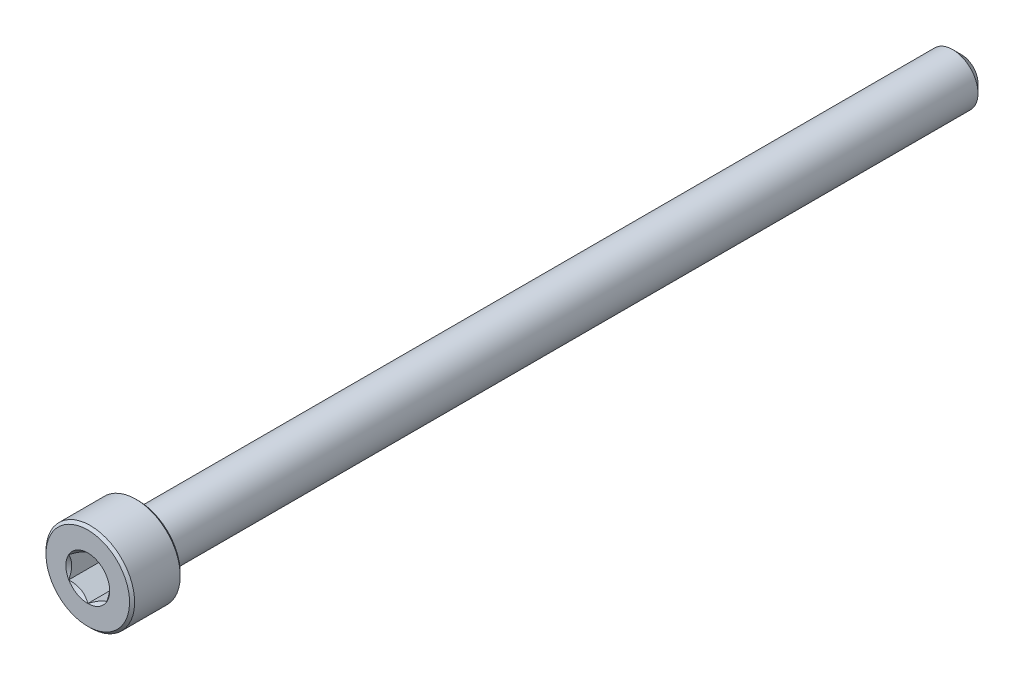
ISO-10303-21;
HEADER;
FILE_DESCRIPTION(('STEP AP214'),'2;1');
FILE_NAME('part.step','',(''),(''),'','','');
FILE_SCHEMA(('AUTOMOTIVE_DESIGN { 1 0 10303 214 1 1 1 1 }'));
ENDSEC;
DATA;
#1=APPLICATION_CONTEXT('core data for automotive mechanical design processes');
#2=APPLICATION_PROTOCOL_DEFINITION('international standard','automotive_design',2000,#1);
#3=PRODUCT_CONTEXT('',#1,'mechanical');
#4=PRODUCT('Part','Part','',(#3));
#5=PRODUCT_RELATED_PRODUCT_CATEGORY('part','',(#4));
#6=PRODUCT_DEFINITION_FORMATION('','',#4);
#7=PRODUCT_DEFINITION_CONTEXT('part definition',#1,'design');
#8=PRODUCT_DEFINITION('design','',#6,#7);
#9=PRODUCT_DEFINITION_SHAPE('','',#8);
#10=(LENGTH_UNIT() NAMED_UNIT(*) SI_UNIT(.MILLI.,.METRE.));
#11=(NAMED_UNIT(*) PLANE_ANGLE_UNIT() SI_UNIT($,.RADIAN.));
#12=(NAMED_UNIT(*) SI_UNIT($,.STERADIAN.) SOLID_ANGLE_UNIT());
#13=UNCERTAINTY_MEASURE_WITH_UNIT(LENGTH_MEASURE(1.E-05),#10,'distance_accuracy_value','');
#14=(GEOMETRIC_REPRESENTATION_CONTEXT(3) GLOBAL_UNCERTAINTY_ASSIGNED_CONTEXT((#13)) GLOBAL_UNIT_ASSIGNED_CONTEXT((#10,
#11,#12)) REPRESENTATION_CONTEXT('',''));
#15=CARTESIAN_POINT('',(0.,0.,0.));
#16=DIRECTION('',(0.,0.,1.));
#17=DIRECTION('',(1.,0.,0.));
#18=AXIS2_PLACEMENT_3D('',#15,#16,#17);
#19=CARTESIAN_POINT('',(0.,0.,34.5));
#20=DIRECTION('',(0.,0.,1.));
#21=DIRECTION('',(0.,-1.,0.));
#22=AXIS2_PLACEMENT_3D('',#19,#20,#21);
#23=PLANE('',#22);
#24=CARTESIAN_POINT('',(0.,0.,34.5));
#25=DIRECTION('',(0.,0.,1.));
#26=DIRECTION('',(1.,0.,0.));
#27=AXIS2_PLACEMENT_3D('',#24,#25,#26);
#28=CIRCLE('',#27,1.73205080756888);
#29=CARTESIAN_POINT('',(0.,-1.73205080756888,34.5));
#30=VERTEX_POINT('',#29);
#31=CARTESIAN_POINT('',(1.5,-0.866025403784438,34.5));
#32=VERTEX_POINT('',#31);
#33=EDGE_CURVE('E106',#30,#32,#28,.T.);
#34=ORIENTED_EDGE('',*,*,#33,.F.);
#35=CARTESIAN_POINT('',(-1.5,-0.866025403784438,34.5));
#36=VERTEX_POINT('',#35);
#37=EDGE_CURVE('E300',#36,#30,#28,.T.);
#38=ORIENTED_EDGE('',*,*,#37,.F.);
#39=CARTESIAN_POINT('',(-1.5,0.866025403784439,34.5));
#40=VERTEX_POINT('',#39);
#41=EDGE_CURVE('E147',#40,#36,#28,.T.);
#42=ORIENTED_EDGE('',*,*,#41,.F.);
#43=CARTESIAN_POINT('',(0.,1.73205080756888,34.5));
#44=VERTEX_POINT('',#43);
#45=EDGE_CURVE('E140',#44,#40,#28,.T.);
#46=ORIENTED_EDGE('',*,*,#45,.F.);
#47=CARTESIAN_POINT('',(1.5,0.866025403784439,34.5));
#48=VERTEX_POINT('',#47);
#49=EDGE_CURVE('E108',#48,#44,#28,.T.);
#50=ORIENTED_EDGE('',*,*,#49,.F.);
#51=EDGE_CURVE('E99',#32,#48,#28,.T.);
#52=ORIENTED_EDGE('',*,*,#51,.F.);
#53=EDGE_LOOP('',(#34,#38,#42,#46,#50,#52));
#54=FACE_BOUND('',#53,.T.);
#55=CARTESIAN_POINT('',(0.,0.,34.5));
#56=DIRECTION('',(0.,0.,-1.));
#57=DIRECTION('',(0.,1.,0.));
#58=AXIS2_PLACEMENT_3D('',#55,#56,#57);
#59=CIRCLE('',#58,3.3);
#60=CARTESIAN_POINT('',(0.,3.3,34.5));
#61=VERTEX_POINT('',#60);
#62=EDGE_CURVE('E55',#61,#61,#59,.T.);
#63=ORIENTED_EDGE('',*,*,#62,.F.);
#64=EDGE_LOOP('',(#63));
#65=FACE_BOUND('',#64,.T.);
#66=ADVANCED_FACE('F41',(#54,#65),#23,.T.);
#67=CARTESIAN_POINT('',(0.,0.,34.3));
#68=DIRECTION('',(0.,0.,-1.));
#69=DIRECTION('',(0.,1.,0.));
#70=AXIS2_PLACEMENT_3D('',#67,#68,#69);
#71=CONICAL_SURFACE('',#70,3.5,0.785398163397435);
#72=ORIENTED_EDGE('',*,*,#62,.T.);
#73=EDGE_LOOP('',(#72));
#74=FACE_BOUND('',#73,.T.);
#75=CARTESIAN_POINT('',(0.,0.,34.3));
#76=DIRECTION('',(0.,0.,-1.));
#77=DIRECTION('',(0.,1.,0.));
#78=AXIS2_PLACEMENT_3D('',#75,#76,#77);
#79=CIRCLE('',#78,3.5);
#80=CARTESIAN_POINT('',(0.,3.5,34.3));
#81=VERTEX_POINT('',#80);
#82=EDGE_CURVE('E233',#81,#81,#79,.T.);
#83=ORIENTED_EDGE('',*,*,#82,.F.);
#84=EDGE_LOOP('',(#83));
#85=FACE_BOUND('',#84,.T.);
#86=ADVANCED_FACE('F221',(#74,#85),#71,.T.);
#87=CARTESIAN_POINT('',(0.,0.,-34.5));
#88=DIRECTION('',(0.,0.,-1.));
#89=DIRECTION('',(0.,1.,0.));
#90=AXIS2_PLACEMENT_3D('',#87,#88,#89);
#91=CYLINDRICAL_SURFACE('',#90,3.5);
#92=ORIENTED_EDGE('',*,*,#82,.T.);
#93=EDGE_LOOP('',(#92));
#94=FACE_BOUND('',#93,.T.);
#95=CARTESIAN_POINT('',(0.,0.,30.7));
#96=DIRECTION('',(0.,0.,-1.));
#97=DIRECTION('',(0.,1.,0.));
#98=AXIS2_PLACEMENT_3D('',#95,#96,#97);
#99=CIRCLE('',#98,3.5);
#100=CARTESIAN_POINT('',(0.,3.5,30.7));
#101=VERTEX_POINT('',#100);
#102=EDGE_CURVE('E235',#101,#101,#99,.T.);
#103=ORIENTED_EDGE('',*,*,#102,.F.);
#104=EDGE_LOOP('',(#103));
#105=FACE_BOUND('',#104,.T.);
#106=ADVANCED_FACE('F218',(#94,#105),#91,.T.);
#107=CARTESIAN_POINT('',(0.,0.,30.5));
#108=DIRECTION('',(0.,0.,1.));
#109=DIRECTION('',(0.,-1.,0.));
#110=AXIS2_PLACEMENT_3D('',#107,#108,#109);
#111=CONICAL_SURFACE('',#110,3.3,0.785398163397434);
#112=ORIENTED_EDGE('',*,*,#102,.T.);
#113=EDGE_LOOP('',(#112));
#114=FACE_BOUND('',#113,.T.);
#115=CARTESIAN_POINT('',(0.,0.,30.5));
#116=DIRECTION('',(0.,0.,-1.));
#117=DIRECTION('',(0.,1.,0.));
#118=AXIS2_PLACEMENT_3D('',#115,#116,#117);
#119=CIRCLE('',#118,3.3);
#120=CARTESIAN_POINT('',(0.,3.3,30.5));
#121=VERTEX_POINT('',#120);
#122=EDGE_CURVE('E240',#121,#121,#119,.T.);
#123=ORIENTED_EDGE('',*,*,#122,.F.);
#124=EDGE_LOOP('',(#123));
#125=FACE_BOUND('',#124,.T.);
#126=ADVANCED_FACE('F214',(#114,#125),#111,.T.);
#127=CARTESIAN_POINT('',(0.,3.3,30.5));
#128=DIRECTION('',(0.,0.,-1.));
#129=DIRECTION('',(0.,1.,0.));
#130=AXIS2_PLACEMENT_3D('',#127,#128,#129);
#131=PLANE('',#130);
#132=ORIENTED_EDGE('',*,*,#122,.T.);
#133=EDGE_LOOP('',(#132));
#134=FACE_BOUND('',#133,.T.);
#135=CARTESIAN_POINT('',(0.,0.,30.5));
#136=DIRECTION('',(0.,0.,-1.));
#137=DIRECTION('',(0.,1.,0.));
#138=AXIS2_PLACEMENT_3D('',#135,#136,#137);
#139=CIRCLE('',#138,1.99999999999999);
#140=CARTESIAN_POINT('',(0.,1.99999999999999,30.5));
#141=VERTEX_POINT('',#140);
#142=EDGE_CURVE('E246',#141,#141,#139,.T.);
#143=ORIENTED_EDGE('',*,*,#142,.F.);
#144=EDGE_LOOP('',(#143));
#145=FACE_BOUND('',#144,.T.);
#146=ADVANCED_FACE('F210',(#134,#145),#131,.T.);
#147=CARTESIAN_POINT('',(0.,0.,-34.5));
#148=DIRECTION('',(0.,0.,-1.));
#149=DIRECTION('',(0.,1.,0.));
#150=AXIS2_PLACEMENT_3D('',#147,#148,#149);
#151=CYLINDRICAL_SURFACE('',#150,1.99999999999999);
#152=ORIENTED_EDGE('',*,*,#142,.T.);
#153=EDGE_LOOP('',(#152));
#154=FACE_BOUND('',#153,.T.);
#155=CARTESIAN_POINT('',(0.,0.,-33.8));
#156=DIRECTION('',(0.,0.,-1.));
#157=DIRECTION('',(0.,1.,0.));
#158=AXIS2_PLACEMENT_3D('',#155,#156,#157);
#159=CIRCLE('',#158,2.);
#160=CARTESIAN_POINT('',(0.,2.,-33.8));
#161=VERTEX_POINT('',#160);
#162=EDGE_CURVE('E250',#161,#161,#159,.T.);
#163=ORIENTED_EDGE('',*,*,#162,.F.);
#164=EDGE_LOOP('',(#163));
#165=FACE_BOUND('',#164,.T.);
#166=ADVANCED_FACE('F206',(#154,#165),#151,.T.);
#167=CARTESIAN_POINT('',(0.,0.,-34.5));
#168=DIRECTION('',(0.,0.,1.));
#169=DIRECTION('',(0.,-1.,0.));
#170=AXIS2_PLACEMENT_3D('',#167,#168,#169);
#171=CONICAL_SURFACE('',#170,1.3,0.785398163397449);
#172=ORIENTED_EDGE('',*,*,#162,.T.);
#173=EDGE_LOOP('',(#172));
#174=FACE_BOUND('',#173,.T.);
#175=CARTESIAN_POINT('',(0.,0.,-34.5));
#176=DIRECTION('',(0.,0.,-1.));
#177=DIRECTION('',(0.,1.,0.));
#178=AXIS2_PLACEMENT_3D('',#175,#176,#177);
#179=CIRCLE('',#178,1.3);
#180=CARTESIAN_POINT('',(0.,1.3,-34.5));
#181=VERTEX_POINT('',#180);
#182=EDGE_CURVE('E254',#181,#181,#179,.T.);
#183=ORIENTED_EDGE('',*,*,#182,.F.);
#184=EDGE_LOOP('',(#183));
#185=FACE_BOUND('',#184,.T.);
#186=ADVANCED_FACE('F202',(#174,#185),#171,.T.);
#187=CARTESIAN_POINT('',(0.,1.3,-34.5));
#188=DIRECTION('',(0.,0.,-1.));
#189=DIRECTION('',(0.,1.,0.));
#190=AXIS2_PLACEMENT_3D('',#187,#188,#189);
#191=PLANE('',#190);
#192=ORIENTED_EDGE('',*,*,#182,.T.);
#193=EDGE_LOOP('',(#192));
#194=FACE_BOUND('',#193,.T.);
#195=ADVANCED_FACE('F199',(#194),#191,.T.);
#196=CARTESIAN_POINT('',(0.,0.,34.5));
#197=DIRECTION('',(0.,0.,1.));
#198=DIRECTION('',(1.,0.,0.));
#199=AXIS2_PLACEMENT_3D('',#196,#197,#198);
#200=CONICAL_SURFACE('',#199,1.73205080756888,0.78539816339745);
#201=ORIENTED_EDGE('',*,*,#33,.T.);
#202=CARTESIAN_POINT('',(-0.000199999999999772,-1.73216627762271,34.5001154816001));
#203=CARTESIAN_POINT('',(0.0513677907370751,-1.70239359975915,34.4703654760673));
#204=CARTESIAN_POINT('',(0.103797917665199,-1.67212305186355,34.4423624839103));
#205=CARTESIAN_POINT('',(0.210709034055595,-1.61039789003619,34.3910892304401));
#206=CARTESIAN_POINT('',(0.26520019581466,-1.57893740312614,34.3678475050444));
#207=CARTESIAN_POINT('',(0.375079081357247,-1.51549879897987,34.3280337289922));
#208=CARTESIAN_POINT('',(0.430438809095198,-1.4835368452681,34.3113615856709));
#209=CARTESIAN_POINT('',(0.542377257477148,-1.41890915196211,34.2856744568181));
#210=CARTESIAN_POINT('',(0.598952556553006,-1.38624538781118,34.2766402904789));
#211=CARTESIAN_POINT('',(0.696455389516438,-1.329952100953,34.2684890812269));
#212=CARTESIAN_POINT('',(0.737256908280463,-1.30639533311124,34.2672822529892));
#213=CARTESIAN_POINT('',(0.818787969615855,-1.25932335290193,34.2693140571623));
#214=CARTESIAN_POINT('',(0.859517494314627,-1.23580815085313,34.2725536707483));
#215=CARTESIAN_POINT('',(0.940584402163413,-1.18900414978427,34.283291985982));
#216=CARTESIAN_POINT('',(0.980921384598285,-1.1657155821172,34.2907946530187));
#217=CARTESIAN_POINT('',(1.06091833691403,-1.11952932016335,34.3096516119283));
#218=CARTESIAN_POINT('',(1.1005780085162,-1.09663179808786,34.3210075570186));
#219=CARTESIAN_POINT('',(1.20216313477448,-1.03798159809699,34.3547216475927));
#220=CARTESIAN_POINT('',(1.26345855370968,-1.00259267147465,34.3796218490934));
#221=CARTESIAN_POINT('',(1.35358562846331,-0.950557780604376,34.4216566532716));
#222=CARTESIAN_POINT('',(1.38328513990771,-0.933410759677149,34.4364251535591));
#223=CARTESIAN_POINT('',(1.44213790138375,-0.899432101996408,34.4673105659402));
#224=CARTESIAN_POINT('',(1.47129140422064,-0.88260031928571,34.4834268341217));
#225=CARTESIAN_POINT('',(1.5002,-0.865909933730599,34.5001154816001));
#226=B_SPLINE_CURVE_WITH_KNOTS('',3,(#202,#203,#204,#205,#206,#207,#208,#209,#210,#211,#212,
#213,#214,#215,#216,#217,#218,#219,#220,#221,#222,#223,#224,#225),.UNSPECIFIED.,.F.,.F.,(4,2,2,
2,2,2,2,2,2,2,2,4),(0.,0.199829143693301,0.400822987382388,0.598623720538179,0.795926240188886,
0.937113067959878,1.07833105577192,1.21968061668222,1.36109089931054,1.58570969637565,
1.69770705470963,1.80965120737194),.UNSPECIFIED.);
#227=EDGE_CURVE('E12',#30,#32,#226,.T.);
#228=ORIENTED_EDGE('',*,*,#227,.F.);
#229=EDGE_LOOP('',(#201,#228));
#230=FACE_BOUND('',#229,.T.);
#231=ADVANCED_FACE('F165',(#230),#200,.F.);
#232=ORIENTED_EDGE('',*,*,#37,.T.);
#233=CARTESIAN_POINT('',(-1.5002,-0.8659099337306,34.5001154816001));
#234=CARTESIAN_POINT('',(-1.44863220926292,-0.895682611594165,34.4703654760673));
#235=CARTESIAN_POINT('',(-1.3962020823348,-0.925953159489764,34.4423624839103));
#236=CARTESIAN_POINT('',(-1.2892909659444,-0.987678321317123,34.3910892304401));
#237=CARTESIAN_POINT('',(-1.23479980418534,-1.01913880822717,34.3678475050444));
#238=CARTESIAN_POINT('',(-1.12492091864275,-1.08257741237344,34.3280337289922));
#239=CARTESIAN_POINT('',(-1.0695611909048,-1.11453936608521,34.3113615856709));
#240=CARTESIAN_POINT('',(-0.957622742522849,-1.1791670593912,34.2856744568181));
#241=CARTESIAN_POINT('',(-0.901047443446992,-1.21183082354213,34.2766402904789));
#242=CARTESIAN_POINT('',(-0.803544610483562,-1.26812411040032,34.2684890812269));
#243=CARTESIAN_POINT('',(-0.762743091719536,-1.29168087824207,34.2672822529892));
#244=CARTESIAN_POINT('',(-0.681212030384145,-1.33875285845138,34.2693140571623));
#245=CARTESIAN_POINT('',(-0.640482505685373,-1.36226806050018,34.2725536707483));
#246=CARTESIAN_POINT('',(-0.559415597836587,-1.40907206156905,34.283291985982));
#247=CARTESIAN_POINT('',(-0.519078615401714,-1.43236062923612,34.2907946530187));
#248=CARTESIAN_POINT('',(-0.439081663085971,-1.47854689118996,34.3096516119283));
#249=CARTESIAN_POINT('',(-0.399421991483795,-1.50144441326545,34.3210075570186));
#250=CARTESIAN_POINT('',(-0.297836865225519,-1.56009461325633,34.3547216475927));
#251=CARTESIAN_POINT('',(-0.236541446290314,-1.59548353987866,34.3796218490934));
#252=CARTESIAN_POINT('',(-0.146414371536689,-1.64751843074894,34.4216566532716));
#253=CARTESIAN_POINT('',(-0.116714860092283,-1.66466545167617,34.4364251535591));
#254=CARTESIAN_POINT('',(-0.0578620986162486,-1.69864410935691,34.4673105659402));
#255=CARTESIAN_POINT('',(-0.0287085957793621,-1.7154758920676,34.4834268341217));
#256=CARTESIAN_POINT('',(0.000200000000000444,-1.73216627762271,34.5001154816001));
#257=B_SPLINE_CURVE_WITH_KNOTS('',3,(#233,#234,#235,#236,#237,#238,#239,#240,#241,#242,#243,
#244,#245,#246,#247,#248,#249,#250,#251,#252,#253,#254,#255,#256),.UNSPECIFIED.,.F.,.F.,(4,2,2,
2,2,2,2,2,2,2,2,4),(0.,0.199829143693308,0.400822987382388,0.598623720538182,0.795926240188887,
0.937113067959878,1.07833105577192,1.21968061668221,1.36109089931054,1.58570969637565,
1.69770705470963,1.80965120737194),.UNSPECIFIED.);
#258=EDGE_CURVE('E142',#36,#30,#257,.T.);
#259=ORIENTED_EDGE('',*,*,#258,.F.);
#260=EDGE_LOOP('',(#232,#259));
#261=FACE_BOUND('',#260,.T.);
#262=ADVANCED_FACE('F298',(#261),#200,.F.);
#263=ORIENTED_EDGE('',*,*,#41,.T.);
#264=CARTESIAN_POINT('',(-1.5,-1.72720812969692,35.0555785162708));
#265=CARTESIAN_POINT('',(-1.5,-1.68515175699268,35.0238299078574));
#266=CARTESIAN_POINT('',(-1.5,-1.64286104748673,34.9923925938074));
#267=CARTESIAN_POINT('',(-1.5,-1.55771581035942,34.9302690875564));
#268=CARTESIAN_POINT('',(-1.5,-1.51486114386668,34.8995830858922));
#269=CARTESIAN_POINT('',(-1.5,-1.3846813415127,34.8084071924272));
#270=CARTESIAN_POINT('',(-1.5,-1.29637976071654,34.7492883434268));
#271=CARTESIAN_POINT('',(-1.5,-1.11121478730467,34.6332309963165));
#272=CARTESIAN_POINT('',(-1.5,-1.01415038238167,34.576609558733));
#273=CARTESIAN_POINT('',(-1.5,-0.815173408897607,34.4730368812657));
#274=CARTESIAN_POINT('',(-1.5,-0.713278669253288,34.4260530415417));
#275=CARTESIAN_POINT('',(-1.5,-0.560333774943114,34.3685726684308));
#276=CARTESIAN_POINT('',(-1.5,-0.511547982948044,34.3520753877573));
#277=CARTESIAN_POINT('',(-1.5,-0.412798620136868,34.322997512927));
#278=CARTESIAN_POINT('',(-1.5,-0.362834968437563,34.310417188594));
#279=CARTESIAN_POINT('',(-1.5,-0.262863235444982,34.2900361941468));
#280=CARTESIAN_POINT('',(-1.5,-0.212872113808023,34.282153632746));
#281=CARTESIAN_POINT('',(-1.5,-0.112355243569545,34.271322063969));
#282=CARTESIAN_POINT('',(-1.5,-0.0618295883726281,34.2683722085243));
#283=CARTESIAN_POINT('',(-1.5,0.0374291733323835,34.2676248577249));
#284=CARTESIAN_POINT('',(-1.5,0.086160967200298,34.2696447335581));
#285=CARTESIAN_POINT('',(-1.5,0.183206937768826,34.2783225528968));
#286=CARTESIAN_POINT('',(-1.5,0.231521073438268,34.2849809469685));
#287=CARTESIAN_POINT('',(-1.5,0.328199853425435,34.3026852441226));
#288=CARTESIAN_POINT('',(-1.5,0.376550616310327,34.313805811257));
#289=CARTESIAN_POINT('',(-1.5,0.472195697125597,34.3398434140487));
#290=CARTESIAN_POINT('',(-1.5,0.519490103092739,34.3547601320409));
#291=CARTESIAN_POINT('',(-1.5,0.668391282696625,34.4073352235961));
#292=CARTESIAN_POINT('',(-1.5,0.767878709508554,34.450981287472));
#293=CARTESIAN_POINT('',(-1.5,0.962179866690723,34.5480229945931));
#294=CARTESIAN_POINT('',(-1.5,1.05697519961444,34.6014536650895));
#295=CARTESIAN_POINT('',(-1.5,1.23814273533382,34.7116858520046));
#296=CARTESIAN_POINT('',(-1.5,1.32469942181289,34.7681879206986));
#297=CARTESIAN_POINT('',(-1.5,1.45222331290673,34.8555343015787));
#298=CARTESIAN_POINT('',(-1.5,1.49418091978755,34.88495775868));
#299=CARTESIAN_POINT('',(-1.5,1.57752272931476,34.9445828218305));
#300=CARTESIAN_POINT('',(-1.5,1.61890708647353,34.9747842116644));
#301=CARTESIAN_POINT('',(-1.5,1.66005278019493,35.0053081786095));
#302=B_SPLINE_CURVE_WITH_KNOTS('',3,(#264,#265,#266,#267,#268,#269,#270,#271,#272,#273,#274,
#275,#276,#277,#278,#279,#280,#281,#282,#283,#284,#285,#286,#287,#288,#289,#290,#291,#292,#293,
#294,#295,#296,#297,#298,#299,#300,#301),.UNSPECIFIED.,.F.,.F.,(4,2,2,2,2,2,2,2,2,2,2,2,2,2,2,2,
2,2,4),(0.,0.158079548982671,0.316198780993938,0.634850417346953,0.971690311361504,
1.30737131660667,1.46173961127088,1.61611853740677,1.76772101421409,1.91929742368538,
2.065387412096,2.21149159305544,2.36014984633872,2.50879566386709,2.83376031422673,
3.15991186985651,3.46985601802197,3.62358896039973,3.77727962642069),.UNSPECIFIED.);
#303=EDGE_CURVE('E145',#40,#36,#302,.F.);
#304=ORIENTED_EDGE('',*,*,#303,.F.);
#305=EDGE_LOOP('',(#263,#304));
#306=FACE_BOUND('',#305,.T.);
#307=ADVANCED_FACE('F303',(#306),#200,.F.);
#308=ORIENTED_EDGE('',*,*,#45,.T.);
#309=CARTESIAN_POINT('',(0.000200000000000089,1.73216627762271,34.5001154816001));
#310=CARTESIAN_POINT('',(-0.0513677907370767,1.70239359975915,34.4703654760673));
#311=CARTESIAN_POINT('',(-0.103797917665202,1.67212305186355,34.4423624839103));
#312=CARTESIAN_POINT('',(-0.210709034055597,1.61039789003619,34.3910892304401));
#313=CARTESIAN_POINT('',(-0.26520019581466,1.57893740312614,34.3678475050444));
#314=CARTESIAN_POINT('',(-0.375079081357247,1.51549879897987,34.3280337289922));
#315=CARTESIAN_POINT('',(-0.430438809095198,1.4835368452681,34.3113615856709));
#316=CARTESIAN_POINT('',(-0.542377257477148,1.41890915196211,34.2856744568181));
#317=CARTESIAN_POINT('',(-0.598952556553006,1.38624538781118,34.2766402904789));
#318=CARTESIAN_POINT('',(-0.696455389516438,1.329952100953,34.2684890812269));
#319=CARTESIAN_POINT('',(-0.737256908280463,1.30639533311124,34.2672822529892));
#320=CARTESIAN_POINT('',(-0.818787969615854,1.25932335290194,34.2693140571623));
#321=CARTESIAN_POINT('',(-0.859517494314626,1.23580815085313,34.2725536707483));
#322=CARTESIAN_POINT('',(-0.940584402163412,1.18900414978427,34.283291985982));
#323=CARTESIAN_POINT('',(-0.980921384598284,1.1657155821172,34.2907946530187));
#324=CARTESIAN_POINT('',(-1.06091833691403,1.11952932016335,34.3096516119283));
#325=CARTESIAN_POINT('',(-1.1005780085162,1.09663179808786,34.3210075570186));
#326=CARTESIAN_POINT('',(-1.20216313477448,1.03798159809698,34.3547216475927));
#327=CARTESIAN_POINT('',(-1.26345855370969,1.00259267147465,34.3796218490934));
#328=CARTESIAN_POINT('',(-1.35358562846331,0.950557780604373,34.4216566532716));
#329=CARTESIAN_POINT('',(-1.38328513990772,0.933410759677146,34.4364251535591));
#330=CARTESIAN_POINT('',(-1.44213790138375,0.899432101996405,34.4673105659402));
#331=CARTESIAN_POINT('',(-1.47129140422064,0.882600319285709,34.4834268341217));
#332=CARTESIAN_POINT('',(-1.5002,0.8659099337306,34.5001154816001));
#333=B_SPLINE_CURVE_WITH_KNOTS('',3,(#309,#310,#311,#312,#313,#314,#315,#316,#317,#318,#319,
#320,#321,#322,#323,#324,#325,#326,#327,#328,#329,#330,#331,#332),.UNSPECIFIED.,.F.,.F.,(4,2,2,
2,2,2,2,2,2,2,2,4),(0.,0.199829143693305,0.400822987382387,0.598623720538179,0.795926240188887,
0.937113067959878,1.07833105577192,1.21968061668222,1.36109089931054,1.58570969637565,
1.69770705470964,1.80965120737194),.UNSPECIFIED.);
#334=EDGE_CURVE('E119',#44,#40,#333,.T.);
#335=ORIENTED_EDGE('',*,*,#334,.F.);
#336=EDGE_LOOP('',(#308,#335));
#337=FACE_BOUND('',#336,.T.);
#338=ADVANCED_FACE('F342',(#337),#200,.F.);
#339=ORIENTED_EDGE('',*,*,#49,.T.);
#340=CARTESIAN_POINT('',(1.5002,0.8659099337306,34.5001154816001));
#341=CARTESIAN_POINT('',(1.44863220926292,0.895682611594165,34.4703654760673));
#342=CARTESIAN_POINT('',(1.3962020823348,0.925953159489764,34.4423624839103));
#343=CARTESIAN_POINT('',(1.2892909659444,0.987678321317122,34.3910892304401));
#344=CARTESIAN_POINT('',(1.23479980418534,1.01913880822717,34.3678475050444));
#345=CARTESIAN_POINT('',(1.12492091864275,1.08257741237344,34.3280337289922));
#346=CARTESIAN_POINT('',(1.0695611909048,1.11453936608521,34.3113615856709));
#347=CARTESIAN_POINT('',(0.957622742522852,1.1791670593912,34.2856744568181));
#348=CARTESIAN_POINT('',(0.901047443446994,1.21183082354213,34.2766402904789));
#349=CARTESIAN_POINT('',(0.803544610483562,1.26812411040032,34.2684890812269));
#350=CARTESIAN_POINT('',(0.762743091719537,1.29168087824207,34.2672822529892));
#351=CARTESIAN_POINT('',(0.681212030384144,1.33875285845138,34.2693140571623));
#352=CARTESIAN_POINT('',(0.640482505685373,1.36226806050018,34.2725536707483));
#353=CARTESIAN_POINT('',(0.559415597836587,1.40907206156905,34.283291985982));
#354=CARTESIAN_POINT('',(0.519078615401715,1.43236062923612,34.2907946530187));
#355=CARTESIAN_POINT('',(0.439081663085972,1.47854689118996,34.3096516119283));
#356=CARTESIAN_POINT('',(0.399421991483796,1.50144441326545,34.3210075570186));
#357=CARTESIAN_POINT('',(0.297836865225519,1.56009461325633,34.3547216475927));
#358=CARTESIAN_POINT('',(0.236541446290314,1.59548353987866,34.3796218490934));
#359=CARTESIAN_POINT('',(0.14641437153669,1.64751843074894,34.4216566532716));
#360=CARTESIAN_POINT('',(0.116714860092286,1.66466545167616,34.4364251535591));
#361=CARTESIAN_POINT('',(0.057862098616252,1.69864410935691,34.4673105659402));
#362=CARTESIAN_POINT('',(0.0287085957793641,1.7154758920676,34.4834268341217));
#363=CARTESIAN_POINT('',(-0.000200000000000555,1.73216627762271,34.5001154816001));
#364=B_SPLINE_CURVE_WITH_KNOTS('',3,(#340,#341,#342,#343,#344,#345,#346,#347,#348,#349,#350,
#351,#352,#353,#354,#355,#356,#357,#358,#359,#360,#361,#362,#363),.UNSPECIFIED.,.F.,.F.,(4,2,2,
2,2,2,2,2,2,2,2,4),(0.,0.199829143693303,0.400822987382388,0.598623720538179,0.795926240188886,
0.937113067959878,1.07833105577192,1.21968061668222,1.36109089931054,1.58570969637565,
1.69770705470963,1.80965120737194),.UNSPECIFIED.);
#365=EDGE_CURVE('E111',#48,#44,#364,.T.);
#366=ORIENTED_EDGE('',*,*,#365,.F.);
#367=EDGE_LOOP('',(#339,#366));
#368=FACE_BOUND('',#367,.T.);
#369=ADVANCED_FACE('F112',(#368),#200,.F.);
#370=ORIENTED_EDGE('',*,*,#51,.T.);
#371=CARTESIAN_POINT('',(1.5,-1.72720812969692,35.0555785162708));
#372=CARTESIAN_POINT('',(1.5,-1.68515175699267,35.0238299078574));
#373=CARTESIAN_POINT('',(1.5,-1.64286104748673,34.9923925938074));
#374=CARTESIAN_POINT('',(1.5,-1.55771581035941,34.9302690875564));
#375=CARTESIAN_POINT('',(1.5,-1.51486114386667,34.8995830858922));
#376=CARTESIAN_POINT('',(1.5,-1.38468134151269,34.8084071924272));
#377=CARTESIAN_POINT('',(1.5,-1.29637976071653,34.7492883434268));
#378=CARTESIAN_POINT('',(1.5,-1.11121478730466,34.6332309963165));
#379=CARTESIAN_POINT('',(1.5,-1.01415038238166,34.576609558733));
#380=CARTESIAN_POINT('',(1.5,-0.815173408897596,34.4730368812656));
#381=CARTESIAN_POINT('',(1.5,-0.713278669253279,34.4260530415417));
#382=CARTESIAN_POINT('',(1.5,-0.560333774943106,34.3685726684308));
#383=CARTESIAN_POINT('',(1.5,-0.511547982948036,34.3520753877573));
#384=CARTESIAN_POINT('',(1.5,-0.41279862013686,34.322997512927));
#385=CARTESIAN_POINT('',(1.5,-0.362834968437556,34.310417188594));
#386=CARTESIAN_POINT('',(1.5,-0.262863235444976,34.2900361941468));
#387=CARTESIAN_POINT('',(1.5,-0.212872113808017,34.282153632746));
#388=CARTESIAN_POINT('',(1.5,-0.112355243569541,34.271322063969));
#389=CARTESIAN_POINT('',(1.5,-0.0618295883726233,34.2683722085244));
#390=CARTESIAN_POINT('',(1.5,0.0374291733323881,34.2676248577249));
#391=CARTESIAN_POINT('',(1.5,0.0861609672003026,34.2696447335581));
#392=CARTESIAN_POINT('',(1.5,0.18320693776883,34.2783225528968));
#393=CARTESIAN_POINT('',(1.5,0.231521073438272,34.2849809469685));
#394=CARTESIAN_POINT('',(1.5,0.328199853425439,34.3026852441226));
#395=CARTESIAN_POINT('',(1.5,0.376550616310331,34.313805811257));
#396=CARTESIAN_POINT('',(1.5,0.472195697125601,34.3398434140487));
#397=CARTESIAN_POINT('',(1.5,0.519490103092742,34.3547601320409));
#398=CARTESIAN_POINT('',(1.5,0.668391282696626,34.4073352235961));
#399=CARTESIAN_POINT('',(1.5,0.767878709508553,34.450981287472));
#400=CARTESIAN_POINT('',(1.5,0.962179866690724,34.5480229945931));
#401=CARTESIAN_POINT('',(1.5,1.05697519961444,34.6014536650895));
#402=CARTESIAN_POINT('',(1.5,1.23814273533383,34.7116858520046));
#403=CARTESIAN_POINT('',(1.5,1.3246994218129,34.7681879206986));
#404=CARTESIAN_POINT('',(1.5,1.45222331290674,34.8555343015787));
#405=CARTESIAN_POINT('',(1.5,1.49418091978756,34.8849577586801));
#406=CARTESIAN_POINT('',(1.5,1.57752272931477,34.9445828218305));
#407=CARTESIAN_POINT('',(1.5,1.61890708647355,34.9747842116644));
#408=CARTESIAN_POINT('',(1.5,1.66005278019494,35.0053081786095));
#409=B_SPLINE_CURVE_WITH_KNOTS('',3,(#371,#372,#373,#374,#375,#376,#377,#378,#379,#380,#381,
#382,#383,#384,#385,#386,#387,#388,#389,#390,#391,#392,#393,#394,#395,#396,#397,#398,#399,#400,
#401,#402,#403,#404,#405,#406,#407,#408),.UNSPECIFIED.,.F.,.F.,(4,2,2,2,2,2,2,2,2,2,2,2,2,2,2,2,
2,2,4),(0.,0.158079548982668,0.316198780993944,0.634850417346959,0.971690311361511,
1.30737131660667,1.46173961127088,1.61611853740677,1.76772101421409,1.91929742368537,
2.06538741209599,2.21149159305543,2.36014984633871,2.50879566386708,2.83376031422672,
3.15991186985651,3.46985601802197,3.62358896039973,3.7772796264207),.UNSPECIFIED.);
#410=EDGE_CURVE('E61',#32,#48,#409,.T.);
#411=ORIENTED_EDGE('',*,*,#410,.F.);
#412=EDGE_LOOP('',(#370,#411));
#413=FACE_BOUND('',#412,.T.);
#414=ADVANCED_FACE('F101',(#413),#200,.F.);
#415=CARTESIAN_POINT('',(0.,3.3,31.5));
#416=DIRECTION('',(0.,0.,-1.));
#417=DIRECTION('',(0.,1.,0.));
#418=AXIS2_PLACEMENT_3D('',#415,#416,#417);
#419=PLANE('',#418);
#420=DIRECTION('',(0.866025403784439,0.5,0.));
#421=VECTOR('',#420,1.);
#422=CARTESIAN_POINT('',(0.,-1.73205080756888,31.5));
#423=LINE('',#422,#421);
#424=CARTESIAN_POINT('',(0.,-1.73205080756888,31.5));
#425=VERTEX_POINT('',#424);
#426=CARTESIAN_POINT('',(1.5,-0.866025403784437,31.5));
#427=VERTEX_POINT('',#426);
#428=EDGE_CURVE('E259',#425,#427,#423,.T.);
#429=ORIENTED_EDGE('',*,*,#428,.T.);
#430=DIRECTION('',(0.,1.,0.));
#431=VECTOR('',#430,1.);
#432=CARTESIAN_POINT('',(1.5,-0.866025403784437,31.5));
#433=LINE('',#432,#431);
#434=CARTESIAN_POINT('',(1.5,0.866025403784438,31.5));
#435=VERTEX_POINT('',#434);
#436=EDGE_CURVE('E130',#427,#435,#433,.T.);
#437=ORIENTED_EDGE('',*,*,#436,.T.);
#438=DIRECTION('',(-0.866025403784439,0.5,0.));
#439=VECTOR('',#438,1.);
#440=CARTESIAN_POINT('',(1.5,0.866025403784438,31.5));
#441=LINE('',#440,#439);
#442=CARTESIAN_POINT('',(0.,1.73205080756888,31.5));
#443=VERTEX_POINT('',#442);
#444=EDGE_CURVE('E134',#435,#443,#441,.T.);
#445=ORIENTED_EDGE('',*,*,#444,.T.);
#446=DIRECTION('',(-0.866025403784439,-0.5,0.));
#447=VECTOR('',#446,1.);
#448=CARTESIAN_POINT('',(0.,1.73205080756888,31.5));
#449=LINE('',#448,#447);
#450=CARTESIAN_POINT('',(-1.5,0.866025403784438,31.5));
#451=VERTEX_POINT('',#450);
#452=EDGE_CURVE('E264',#443,#451,#449,.T.);
#453=ORIENTED_EDGE('',*,*,#452,.T.);
#454=DIRECTION('',(0.,-1.,0.));
#455=VECTOR('',#454,1.);
#456=CARTESIAN_POINT('',(-1.5,0.866025403784438,31.5));
#457=LINE('',#456,#455);
#458=CARTESIAN_POINT('',(-1.5,-0.866025403784438,31.5));
#459=VERTEX_POINT('',#458);
#460=EDGE_CURVE('E269',#451,#459,#457,.T.);
#461=ORIENTED_EDGE('',*,*,#460,.T.);
#462=DIRECTION('',(0.866025403784439,-0.5,0.));
#463=VECTOR('',#462,1.);
#464=CARTESIAN_POINT('',(-1.5,-0.866025403784438,31.5));
#465=LINE('',#464,#463);
#466=EDGE_CURVE('E272',#459,#425,#465,.T.);
#467=ORIENTED_EDGE('',*,*,#466,.T.);
#468=EDGE_LOOP('',(#429,#437,#445,#453,#461,#467));
#469=FACE_BOUND('',#468,.T.);
#470=ADVANCED_FACE('F164',(#469),#419,.F.);
#471=CARTESIAN_POINT('',(0.,-1.73205080756888,25.9174243050442));
#472=DIRECTION('',(0.5,-0.866025403784438,0.));
#473=DIRECTION('',(0.866025403784439,0.5,0.));
#474=AXIS2_PLACEMENT_3D('',#471,#472,#473);
#475=PLANE('',#474);
#476=DIRECTION('',(0.,0.,1.));
#477=VECTOR('',#476,1.);
#478=CARTESIAN_POINT('',(0.,-1.73205080756888,25.9174243050442));
#479=LINE('',#478,#477);
#480=EDGE_CURVE('E273',#425,#30,#479,.T.);
#481=ORIENTED_EDGE('',*,*,#480,.T.);
#482=ORIENTED_EDGE('',*,*,#227,.T.);
#483=DIRECTION('',(0.,0.,1.));
#484=VECTOR('',#483,1.);
#485=CARTESIAN_POINT('',(1.5,-0.866025403784437,25.9174243050442));
#486=LINE('',#485,#484);
#487=EDGE_CURVE('E128',#427,#32,#486,.T.);
#488=ORIENTED_EDGE('',*,*,#487,.F.);
#489=ORIENTED_EDGE('',*,*,#428,.F.);
#490=EDGE_LOOP('',(#481,#482,#488,#489));
#491=FACE_BOUND('',#490,.T.);
#492=ADVANCED_FACE('F166',(#491),#475,.F.);
#493=CARTESIAN_POINT('',(-1.5,-0.866025403784438,25.9174243050442));
#494=DIRECTION('',(-0.5,-0.866025403784439,0.));
#495=DIRECTION('',(0.866025403784439,-0.5,0.));
#496=AXIS2_PLACEMENT_3D('',#493,#494,#495);
#497=PLANE('',#496);
#498=DIRECTION('',(0.,0.,1.));
#499=VECTOR('',#498,1.);
#500=CARTESIAN_POINT('',(-1.5,-0.866025403784438,25.9174243050442));
#501=LINE('',#500,#499);
#502=EDGE_CURVE('E69',#459,#36,#501,.T.);
#503=ORIENTED_EDGE('',*,*,#502,.T.);
#504=ORIENTED_EDGE('',*,*,#258,.T.);
#505=ORIENTED_EDGE('',*,*,#480,.F.);
#506=ORIENTED_EDGE('',*,*,#466,.F.);
#507=EDGE_LOOP('',(#503,#504,#505,#506));
#508=FACE_BOUND('',#507,.T.);
#509=ADVANCED_FACE('F160',(#508),#497,.F.);
#510=CARTESIAN_POINT('',(-1.5,0.866025403784438,25.9174243050442));
#511=DIRECTION('',(-1.,0.,0.));
#512=DIRECTION('',(0.,-1.,0.));
#513=AXIS2_PLACEMENT_3D('',#510,#511,#512);
#514=PLANE('',#513);
#515=DIRECTION('',(0.,0.,1.));
#516=VECTOR('',#515,1.);
#517=CARTESIAN_POINT('',(-1.5,0.866025403784438,25.9174243050442));
#518=LINE('',#517,#516);
#519=EDGE_CURVE('E265',#451,#40,#518,.T.);
#520=ORIENTED_EDGE('',*,*,#519,.T.);
#521=ORIENTED_EDGE('',*,*,#303,.T.);
#522=ORIENTED_EDGE('',*,*,#502,.F.);
#523=ORIENTED_EDGE('',*,*,#460,.F.);
#524=EDGE_LOOP('',(#520,#521,#522,#523));
#525=FACE_BOUND('',#524,.T.);
#526=ADVANCED_FACE('F314',(#525),#514,.F.);
#527=CARTESIAN_POINT('',(0.,1.73205080756888,25.9174243050442));
#528=DIRECTION('',(-0.5,0.866025403784439,0.));
#529=DIRECTION('',(-0.866025403784439,-0.5,0.));
#530=AXIS2_PLACEMENT_3D('',#527,#528,#529);
#531=PLANE('',#530);
#532=DIRECTION('',(0.,0.,1.));
#533=VECTOR('',#532,1.);
#534=CARTESIAN_POINT('',(0.,1.73205080756888,25.9174243050442));
#535=LINE('',#534,#533);
#536=EDGE_CURVE('E261',#443,#44,#535,.T.);
#537=ORIENTED_EDGE('',*,*,#536,.T.);
#538=ORIENTED_EDGE('',*,*,#334,.T.);
#539=ORIENTED_EDGE('',*,*,#519,.F.);
#540=ORIENTED_EDGE('',*,*,#452,.F.);
#541=EDGE_LOOP('',(#537,#538,#539,#540));
#542=FACE_BOUND('',#541,.T.);
#543=ADVANCED_FACE('F191',(#542),#531,.F.);
#544=CARTESIAN_POINT('',(1.5,0.866025403784438,25.9174243050442));
#545=DIRECTION('',(0.5,0.866025403784439,0.));
#546=DIRECTION('',(-0.866025403784439,0.5,0.));
#547=AXIS2_PLACEMENT_3D('',#544,#545,#546);
#548=PLANE('',#547);
#549=DIRECTION('',(0.,0.,1.));
#550=VECTOR('',#549,1.);
#551=CARTESIAN_POINT('',(1.5,0.866025403784438,25.9174243050442));
#552=LINE('',#551,#550);
#553=EDGE_CURVE('E125',#435,#48,#552,.T.);
#554=ORIENTED_EDGE('',*,*,#553,.T.);
#555=ORIENTED_EDGE('',*,*,#365,.T.);
#556=ORIENTED_EDGE('',*,*,#536,.F.);
#557=ORIENTED_EDGE('',*,*,#444,.F.);
#558=EDGE_LOOP('',(#554,#555,#556,#557));
#559=FACE_BOUND('',#558,.T.);
#560=ADVANCED_FACE('F132',(#559),#548,.F.);
#561=CARTESIAN_POINT('',(1.5,-0.866025403784437,25.9174243050442));
#562=DIRECTION('',(1.,0.,0.));
#563=DIRECTION('',(0.,1.,0.));
#564=AXIS2_PLACEMENT_3D('',#561,#562,#563);
#565=PLANE('',#564);
#566=ORIENTED_EDGE('',*,*,#487,.T.);
#567=ORIENTED_EDGE('',*,*,#410,.T.);
#568=ORIENTED_EDGE('',*,*,#553,.F.);
#569=ORIENTED_EDGE('',*,*,#436,.F.);
#570=EDGE_LOOP('',(#566,#567,#568,#569));
#571=FACE_BOUND('',#570,.T.);
#572=ADVANCED_FACE('F124',(#571),#565,.F.);
#573=CLOSED_SHELL('',(#66,#86,#106,#126,#146,#166,#186,#195,#231,#262,#307,#338,#369,#414,#470,
#492,#509,#526,#543,#560,#572));
#574=MANIFOLD_SOLID_BREP('B2',#573);
#575=ADVANCED_BREP_SHAPE_REPRESENTATION('',(#18,#574),#14);
#576=SHAPE_DEFINITION_REPRESENTATION(#9,#575);
ENDSEC;
END-ISO-10303-21;
